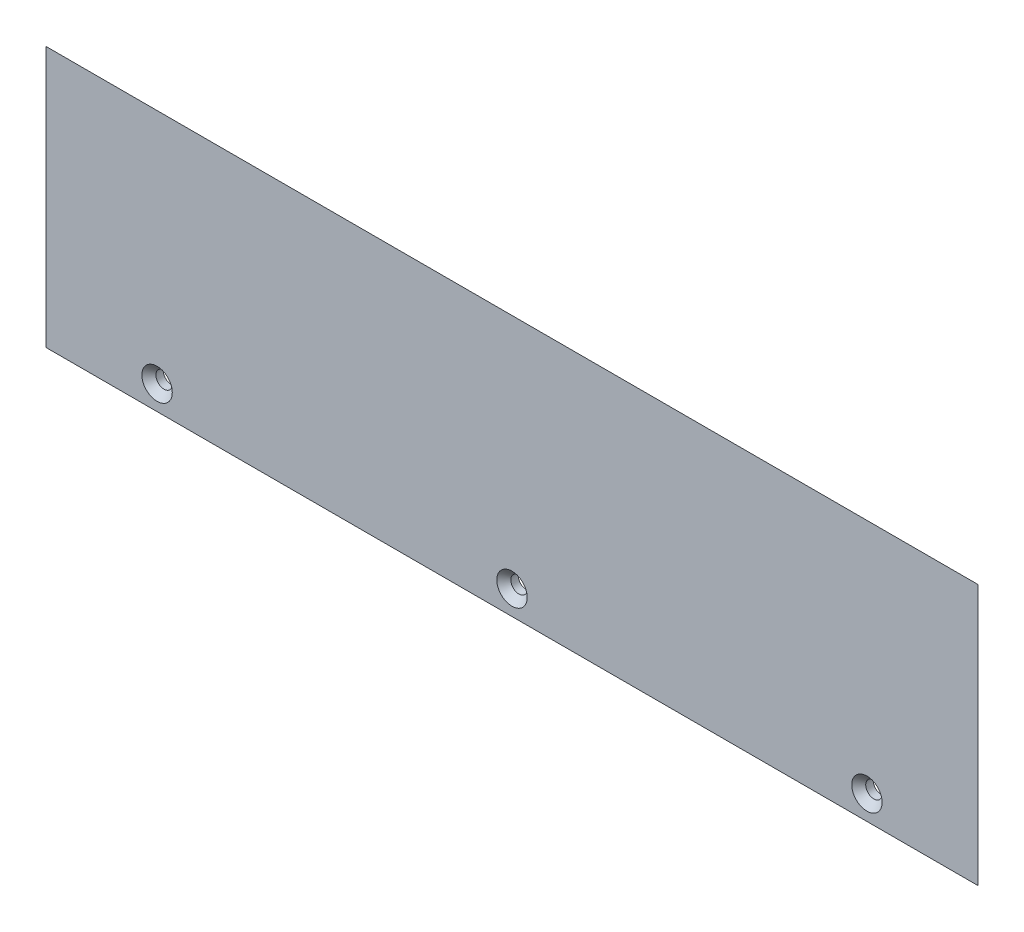
ISO-10303-21;
HEADER;
FILE_DESCRIPTION(('STEP AP214'),'2;1');
FILE_NAME('part.step','',(''),(''),'','','');
FILE_SCHEMA(('AUTOMOTIVE_DESIGN { 1 0 10303 214 1 1 1 1 }'));
ENDSEC;
DATA;
#1=APPLICATION_CONTEXT('core data for automotive mechanical design processes');
#2=APPLICATION_PROTOCOL_DEFINITION('international standard','automotive_design',2000,#1);
#3=PRODUCT_CONTEXT('',#1,'mechanical');
#4=PRODUCT('Part','Part','',(#3));
#5=PRODUCT_RELATED_PRODUCT_CATEGORY('part','',(#4));
#6=PRODUCT_DEFINITION_FORMATION('','',#4);
#7=PRODUCT_DEFINITION_CONTEXT('part definition',#1,'design');
#8=PRODUCT_DEFINITION('design','',#6,#7);
#9=PRODUCT_DEFINITION_SHAPE('','',#8);
#10=(LENGTH_UNIT() NAMED_UNIT(*) SI_UNIT(.MILLI.,.METRE.));
#11=(NAMED_UNIT(*) PLANE_ANGLE_UNIT() SI_UNIT($,.RADIAN.));
#12=(NAMED_UNIT(*) SI_UNIT($,.STERADIAN.) SOLID_ANGLE_UNIT());
#13=UNCERTAINTY_MEASURE_WITH_UNIT(LENGTH_MEASURE(1.E-05),#10,'distance_accuracy_value','');
#14=(GEOMETRIC_REPRESENTATION_CONTEXT(3) GLOBAL_UNCERTAINTY_ASSIGNED_CONTEXT((#13)) GLOBAL_UNIT_ASSIGNED_CONTEXT((#10,
#11,#12)) REPRESENTATION_CONTEXT('',''));
#15=CARTESIAN_POINT('',(0.,0.,0.));
#16=DIRECTION('',(0.,0.,1.));
#17=DIRECTION('',(1.,0.,0.));
#18=AXIS2_PLACEMENT_3D('',#15,#16,#17);
#19=CARTESIAN_POINT('',(0.,0.,3.));
#20=DIRECTION('',(0.,1.,0.));
#21=DIRECTION('',(0.,0.,1.));
#22=AXIS2_PLACEMENT_3D('',#19,#20,#21);
#23=PLANE('',#22);
#24=DIRECTION('',(1.,0.,0.));
#25=VECTOR('',#24,1.);
#26=CARTESIAN_POINT('',(0.,0.,3.));
#27=LINE('',#26,#25);
#28=CARTESIAN_POINT('',(0.,0.,3.));
#29=VERTEX_POINT('',#28);
#30=CARTESIAN_POINT('',(193.,0.,3.));
#31=VERTEX_POINT('',#30);
#32=EDGE_CURVE('E85',#29,#31,#27,.T.);
#33=ORIENTED_EDGE('',*,*,#32,.F.);
#34=DIRECTION('',(0.707106781186551,0.,-0.707106781186544));
#35=VECTOR('',#34,1.);
#36=CARTESIAN_POINT('',(0.,0.,2.99999999999998));
#37=LINE('',#36,#35);
#38=CARTESIAN_POINT('',(3.,0.,0.));
#39=VERTEX_POINT('',#38);
#40=EDGE_CURVE('E73',#29,#39,#37,.T.);
#41=ORIENTED_EDGE('',*,*,#40,.T.);
#42=DIRECTION('',(1.,0.,0.));
#43=VECTOR('',#42,1.);
#44=CARTESIAN_POINT('',(0.,0.,0.));
#45=LINE('',#44,#43);
#46=CARTESIAN_POINT('',(190.,0.,0.));
#47=VERTEX_POINT('',#46);
#48=EDGE_CURVE('E95',#39,#47,#45,.T.);
#49=ORIENTED_EDGE('',*,*,#48,.T.);
#50=DIRECTION('',(0.707106781186551,0.,0.707106781186544));
#51=VECTOR('',#50,1.);
#52=CARTESIAN_POINT('',(193.,0.,2.99999999999998));
#53=LINE('',#52,#51);
#54=EDGE_CURVE('E82',#47,#31,#53,.T.);
#55=ORIENTED_EDGE('',*,*,#54,.T.);
#56=EDGE_LOOP('',(#33,#41,#49,#55));
#57=FACE_BOUND('',#56,.T.);
#58=ADVANCED_FACE('F35',(#57),#23,.F.);
#59=CARTESIAN_POINT('',(0.,0.,3.));
#60=DIRECTION('',(0.,0.,-1.));
#61=DIRECTION('',(-1.,0.,0.));
#62=AXIS2_PLACEMENT_3D('',#59,#60,#61);
#63=PLANE('',#62);
#64=CARTESIAN_POINT('',(23.,5.,3.));
#65=DIRECTION('',(0.,0.,1.));
#66=DIRECTION('',(1.,0.,0.));
#67=AXIS2_PLACEMENT_3D('',#64,#65,#66);
#68=CIRCLE('',#67,3.15);
#69=CARTESIAN_POINT('',(26.15,5.,3.));
#70=VERTEX_POINT('',#69);
#71=EDGE_CURVE('E134',#70,#70,#68,.T.);
#72=ORIENTED_EDGE('',*,*,#71,.F.);
#73=EDGE_LOOP('',(#72));
#74=FACE_BOUND('',#73,.T.);
#75=CARTESIAN_POINT('',(96.5,5.,3.));
#76=DIRECTION('',(0.,0.,1.));
#77=DIRECTION('',(1.,0.,0.));
#78=AXIS2_PLACEMENT_3D('',#75,#76,#77);
#79=CIRCLE('',#78,3.15);
#80=CARTESIAN_POINT('',(99.65,5.,3.));
#81=VERTEX_POINT('',#80);
#82=EDGE_CURVE('E125',#81,#81,#79,.T.);
#83=ORIENTED_EDGE('',*,*,#82,.F.);
#84=EDGE_LOOP('',(#83));
#85=FACE_BOUND('',#84,.T.);
#86=CARTESIAN_POINT('',(170.,5.,3.));
#87=DIRECTION('',(0.,0.,1.));
#88=DIRECTION('',(1.,0.,0.));
#89=AXIS2_PLACEMENT_3D('',#86,#87,#88);
#90=CIRCLE('',#89,3.15000000000001);
#91=CARTESIAN_POINT('',(173.15,5.,3.));
#92=VERTEX_POINT('',#91);
#93=EDGE_CURVE('E113',#92,#92,#90,.T.);
#94=ORIENTED_EDGE('',*,*,#93,.F.);
#95=EDGE_LOOP('',(#94));
#96=FACE_BOUND('',#95,.T.);
#97=DIRECTION('',(0.,-1.,0.));
#98=VECTOR('',#97,1.);
#99=CARTESIAN_POINT('',(0.,0.,3.));
#100=LINE('',#99,#98);
#101=CARTESIAN_POINT('',(0.,54.,3.));
#102=VERTEX_POINT('',#101);
#103=EDGE_CURVE('E78',#102,#29,#100,.T.);
#104=ORIENTED_EDGE('',*,*,#103,.T.);
#105=ORIENTED_EDGE('',*,*,#32,.T.);
#106=DIRECTION('',(0.,1.,0.));
#107=VECTOR('',#106,1.);
#108=CARTESIAN_POINT('',(193.,0.,3.));
#109=LINE('',#108,#107);
#110=CARTESIAN_POINT('',(193.,54.,3.));
#111=VERTEX_POINT('',#110);
#112=EDGE_CURVE('E89',#31,#111,#109,.T.);
#113=ORIENTED_EDGE('',*,*,#112,.T.);
#114=DIRECTION('',(-1.,0.,0.));
#115=VECTOR('',#114,1.);
#116=CARTESIAN_POINT('',(0.,54.,3.));
#117=LINE('',#116,#115);
#118=EDGE_CURVE('E93',#111,#102,#117,.T.);
#119=ORIENTED_EDGE('',*,*,#118,.T.);
#120=EDGE_LOOP('',(#104,#105,#113,#119));
#121=FACE_BOUND('',#120,.T.);
#122=ADVANCED_FACE('F91',(#74,#85,#96,#121),#63,.F.);
#123=CARTESIAN_POINT('',(0.,0.,0.));
#124=DIRECTION('',(0.,0.,-1.));
#125=DIRECTION('',(-1.,0.,0.));
#126=AXIS2_PLACEMENT_3D('',#123,#124,#125);
#127=PLANE('',#126);
#128=CARTESIAN_POINT('',(23.,5.,0.));
#129=DIRECTION('',(0.,0.,1.));
#130=DIRECTION('',(1.,0.,0.));
#131=AXIS2_PLACEMENT_3D('',#128,#129,#130);
#132=CIRCLE('',#131,1.69999999999999);
#133=CARTESIAN_POINT('',(24.7,5.,0.));
#134=VERTEX_POINT('',#133);
#135=EDGE_CURVE('E128',#134,#134,#132,.T.);
#136=ORIENTED_EDGE('',*,*,#135,.T.);
#137=EDGE_LOOP('',(#136));
#138=FACE_BOUND('',#137,.T.);
#139=CARTESIAN_POINT('',(96.5,5.,0.));
#140=DIRECTION('',(0.,0.,1.));
#141=DIRECTION('',(1.,0.,0.));
#142=AXIS2_PLACEMENT_3D('',#139,#140,#141);
#143=CIRCLE('',#142,1.69999999999999);
#144=CARTESIAN_POINT('',(98.2,5.,0.));
#145=VERTEX_POINT('',#144);
#146=EDGE_CURVE('E117',#145,#145,#143,.T.);
#147=ORIENTED_EDGE('',*,*,#146,.T.);
#148=EDGE_LOOP('',(#147));
#149=FACE_BOUND('',#148,.T.);
#150=CARTESIAN_POINT('',(170.,5.,0.));
#151=DIRECTION('',(0.,0.,1.));
#152=DIRECTION('',(1.,0.,0.));
#153=AXIS2_PLACEMENT_3D('',#150,#151,#152);
#154=CIRCLE('',#153,1.69999999999998);
#155=CARTESIAN_POINT('',(171.7,5.,0.));
#156=VERTEX_POINT('',#155);
#157=EDGE_CURVE('E99',#156,#156,#154,.T.);
#158=ORIENTED_EDGE('',*,*,#157,.T.);
#159=EDGE_LOOP('',(#158));
#160=FACE_BOUND('',#159,.T.);
#161=ORIENTED_EDGE('',*,*,#48,.F.);
#162=DIRECTION('',(0.,1.,0.));
#163=VECTOR('',#162,1.);
#164=CARTESIAN_POINT('',(3.,54.,0.));
#165=LINE('',#164,#163);
#166=CARTESIAN_POINT('',(3.,51.,0.));
#167=VERTEX_POINT('',#166);
#168=EDGE_CURVE('E11',#39,#167,#165,.T.);
#169=ORIENTED_EDGE('',*,*,#168,.T.);
#170=DIRECTION('',(1.,0.,0.));
#171=VECTOR('',#170,1.);
#172=CARTESIAN_POINT('',(193.,51.,0.));
#173=LINE('',#172,#171);
#174=CARTESIAN_POINT('',(190.,51.,0.));
#175=VERTEX_POINT('',#174);
#176=EDGE_CURVE('E44',#167,#175,#173,.T.);
#177=ORIENTED_EDGE('',*,*,#176,.T.);
#178=DIRECTION('',(0.,-1.,0.));
#179=VECTOR('',#178,1.);
#180=CARTESIAN_POINT('',(190.,0.,0.));
#181=LINE('',#180,#179);
#182=EDGE_CURVE('E81',#175,#47,#181,.T.);
#183=ORIENTED_EDGE('',*,*,#182,.T.);
#184=EDGE_LOOP('',(#161,#169,#177,#183));
#185=FACE_BOUND('',#184,.T.);
#186=ADVANCED_FACE('F142',(#138,#149,#160,#185),#127,.T.);
#187=CARTESIAN_POINT('',(193.,0.,2.99999999999998));
#188=DIRECTION('',(0.707106781186544,0.,-0.707106781186551));
#189=DIRECTION('',(0.,-1.,0.));
#190=AXIS2_PLACEMENT_3D('',#187,#188,#189);
#191=PLANE('',#190);
#192=ORIENTED_EDGE('',*,*,#54,.F.);
#193=ORIENTED_EDGE('',*,*,#182,.F.);
#194=DIRECTION('',(0.577350269189628,0.577350269189628,0.577350269189622));
#195=VECTOR('',#194,1.);
#196=CARTESIAN_POINT('',(175.,35.9999999999999,-15.));
#197=LINE('',#196,#195);
#198=EDGE_CURVE('E39',#111,#175,#197,.F.);
#199=ORIENTED_EDGE('',*,*,#198,.F.);
#200=ORIENTED_EDGE('',*,*,#112,.F.);
#201=EDGE_LOOP('',(#192,#193,#199,#200));
#202=FACE_BOUND('',#201,.T.);
#203=ADVANCED_FACE('F37',(#202),#191,.T.);
#204=CARTESIAN_POINT('',(0.,54.,2.99999999999998));
#205=DIRECTION('',(0.,0.707106781186544,-0.707106781186551));
#206=DIRECTION('',(1.,0.,0.));
#207=AXIS2_PLACEMENT_3D('',#204,#205,#206);
#208=PLANE('',#207);
#209=ORIENTED_EDGE('',*,*,#198,.T.);
#210=ORIENTED_EDGE('',*,*,#176,.F.);
#211=DIRECTION('',(-0.577350269189628,0.577350269189628,0.577350269189622));
#212=VECTOR('',#211,1.);
#213=CARTESIAN_POINT('',(0.,54.,2.99999999999998));
#214=LINE('',#213,#212);
#215=EDGE_CURVE('E106',#102,#167,#214,.F.);
#216=ORIENTED_EDGE('',*,*,#215,.F.);
#217=ORIENTED_EDGE('',*,*,#118,.F.);
#218=EDGE_LOOP('',(#209,#210,#216,#217));
#219=FACE_BOUND('',#218,.T.);
#220=ADVANCED_FACE('F170',(#219),#208,.T.);
#221=CARTESIAN_POINT('',(0.,0.,2.99999999999998));
#222=DIRECTION('',(-0.707106781186544,0.,-0.707106781186551));
#223=DIRECTION('',(0.,1.,0.));
#224=AXIS2_PLACEMENT_3D('',#221,#222,#223);
#225=PLANE('',#224);
#226=ORIENTED_EDGE('',*,*,#215,.T.);
#227=ORIENTED_EDGE('',*,*,#168,.F.);
#228=ORIENTED_EDGE('',*,*,#40,.F.);
#229=ORIENTED_EDGE('',*,*,#103,.F.);
#230=EDGE_LOOP('',(#226,#227,#228,#229));
#231=FACE_BOUND('',#230,.T.);
#232=ADVANCED_FACE('F76',(#231),#225,.T.);
#233=CARTESIAN_POINT('',(170.,5.,3.));
#234=DIRECTION('',(0.,0.,1.));
#235=DIRECTION('',(1.,0.,0.));
#236=AXIS2_PLACEMENT_3D('',#233,#234,#235);
#237=CYLINDRICAL_SURFACE('',#236,1.69999999999998);
#238=ORIENTED_EDGE('',*,*,#157,.F.);
#239=EDGE_LOOP('',(#238));
#240=FACE_BOUND('',#239,.T.);
#241=CARTESIAN_POINT('',(170.,5.,1.54999999999999));
#242=DIRECTION('',(0.,0.,1.));
#243=DIRECTION('',(1.,0.,0.));
#244=AXIS2_PLACEMENT_3D('',#241,#242,#243);
#245=CIRCLE('',#244,1.69999999999998);
#246=CARTESIAN_POINT('',(171.7,5.,1.54999999999999));
#247=VERTEX_POINT('',#246);
#248=EDGE_CURVE('E109',#247,#247,#245,.T.);
#249=ORIENTED_EDGE('',*,*,#248,.T.);
#250=EDGE_LOOP('',(#249));
#251=FACE_BOUND('',#250,.T.);
#252=ADVANCED_FACE('F151',(#240,#251),#237,.F.);
#253=CARTESIAN_POINT('',(170.,5.,3.));
#254=DIRECTION('',(0.,0.,1.));
#255=DIRECTION('',(1.,0.,0.));
#256=AXIS2_PLACEMENT_3D('',#253,#254,#255);
#257=CONICAL_SURFACE('',#256,3.15000000000001,0.785398163397457);
#258=ORIENTED_EDGE('',*,*,#248,.F.);
#259=EDGE_LOOP('',(#258));
#260=FACE_BOUND('',#259,.T.);
#261=ORIENTED_EDGE('',*,*,#93,.T.);
#262=EDGE_LOOP('',(#261));
#263=FACE_BOUND('',#262,.T.);
#264=ADVANCED_FACE('F148',(#260,#263),#257,.F.);
#265=CARTESIAN_POINT('',(96.5,5.,3.));
#266=DIRECTION('',(0.,0.,1.));
#267=DIRECTION('',(1.,0.,0.));
#268=AXIS2_PLACEMENT_3D('',#265,#266,#267);
#269=CYLINDRICAL_SURFACE('',#268,1.69999999999999);
#270=ORIENTED_EDGE('',*,*,#146,.F.);
#271=EDGE_LOOP('',(#270));
#272=FACE_BOUND('',#271,.T.);
#273=CARTESIAN_POINT('',(96.5,5.,1.54999999999999));
#274=DIRECTION('',(0.,0.,1.));
#275=DIRECTION('',(1.,0.,0.));
#276=AXIS2_PLACEMENT_3D('',#273,#274,#275);
#277=CIRCLE('',#276,1.69999999999999);
#278=CARTESIAN_POINT('',(98.2,5.,1.54999999999999));
#279=VERTEX_POINT('',#278);
#280=EDGE_CURVE('E122',#279,#279,#277,.T.);
#281=ORIENTED_EDGE('',*,*,#280,.T.);
#282=EDGE_LOOP('',(#281));
#283=FACE_BOUND('',#282,.T.);
#284=ADVANCED_FACE('F150',(#272,#283),#269,.F.);
#285=CARTESIAN_POINT('',(96.5,5.,3.));
#286=DIRECTION('',(0.,0.,1.));
#287=DIRECTION('',(1.,0.,0.));
#288=AXIS2_PLACEMENT_3D('',#285,#286,#287);
#289=CONICAL_SURFACE('',#288,3.15,0.785398163397448);
#290=ORIENTED_EDGE('',*,*,#280,.F.);
#291=EDGE_LOOP('',(#290));
#292=FACE_BOUND('',#291,.T.);
#293=ORIENTED_EDGE('',*,*,#82,.T.);
#294=EDGE_LOOP('',(#293));
#295=FACE_BOUND('',#294,.T.);
#296=ADVANCED_FACE('F158',(#292,#295),#289,.F.);
#297=CARTESIAN_POINT('',(23.,5.,3.));
#298=DIRECTION('',(0.,0.,1.));
#299=DIRECTION('',(1.,0.,0.));
#300=AXIS2_PLACEMENT_3D('',#297,#298,#299);
#301=CYLINDRICAL_SURFACE('',#300,1.69999999999999);
#302=ORIENTED_EDGE('',*,*,#135,.F.);
#303=EDGE_LOOP('',(#302));
#304=FACE_BOUND('',#303,.T.);
#305=CARTESIAN_POINT('',(23.,5.,1.54999999999999));
#306=DIRECTION('',(0.,0.,1.));
#307=DIRECTION('',(1.,0.,0.));
#308=AXIS2_PLACEMENT_3D('',#305,#306,#307);
#309=CIRCLE('',#308,1.69999999999999);
#310=CARTESIAN_POINT('',(24.7,5.,1.54999999999999));
#311=VERTEX_POINT('',#310);
#312=EDGE_CURVE('E131',#311,#311,#309,.T.);
#313=ORIENTED_EDGE('',*,*,#312,.T.);
#314=EDGE_LOOP('',(#313));
#315=FACE_BOUND('',#314,.T.);
#316=ADVANCED_FACE('F190',(#304,#315),#301,.F.);
#317=CARTESIAN_POINT('',(23.,5.,3.));
#318=DIRECTION('',(0.,0.,1.));
#319=DIRECTION('',(1.,0.,0.));
#320=AXIS2_PLACEMENT_3D('',#317,#318,#319);
#321=CONICAL_SURFACE('',#320,3.15,0.78539816339745);
#322=ORIENTED_EDGE('',*,*,#312,.F.);
#323=EDGE_LOOP('',(#322));
#324=FACE_BOUND('',#323,.T.);
#325=ORIENTED_EDGE('',*,*,#71,.T.);
#326=EDGE_LOOP('',(#325));
#327=FACE_BOUND('',#326,.T.);
#328=ADVANCED_FACE('F138',(#324,#327),#321,.F.);
#329=CLOSED_SHELL('',(#58,#122,#186,#203,#220,#232,#252,#264,#284,#296,#316,#328));
#330=MANIFOLD_SOLID_BREP('B2',#329);
#331=ADVANCED_BREP_SHAPE_REPRESENTATION('',(#18,#330),#14);
#332=SHAPE_DEFINITION_REPRESENTATION(#9,#331);
ENDSEC;
END-ISO-10303-21;
